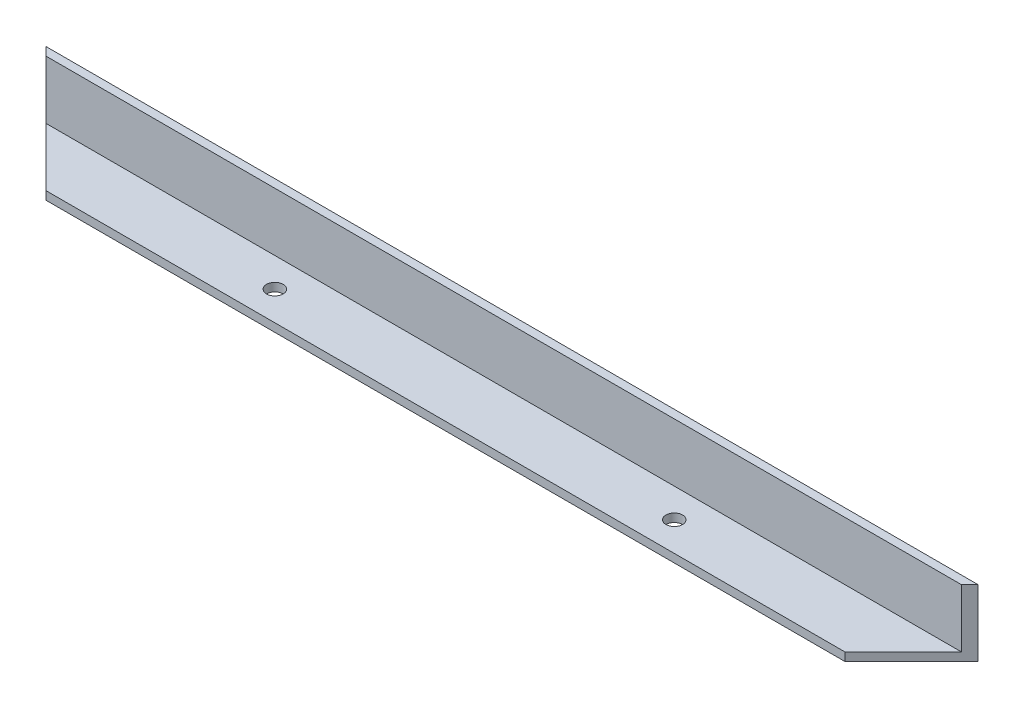
ISO-10303-21;
HEADER;
FILE_DESCRIPTION(('STEP AP214'),'2;1');
FILE_NAME('part.step','',(''),(''),'','','');
FILE_SCHEMA(('AUTOMOTIVE_DESIGN { 1 0 10303 214 1 1 1 1 }'));
ENDSEC;
DATA;
#1=APPLICATION_CONTEXT('core data for automotive mechanical design processes');
#2=APPLICATION_PROTOCOL_DEFINITION('international standard','automotive_design',2000,#1);
#3=PRODUCT_CONTEXT('',#1,'mechanical');
#4=PRODUCT('Part','Part','',(#3));
#5=PRODUCT_RELATED_PRODUCT_CATEGORY('part','',(#4));
#6=PRODUCT_DEFINITION_FORMATION('','',#4);
#7=PRODUCT_DEFINITION_CONTEXT('part definition',#1,'design');
#8=PRODUCT_DEFINITION('design','',#6,#7);
#9=PRODUCT_DEFINITION_SHAPE('','',#8);
#10=(LENGTH_UNIT() NAMED_UNIT(*) SI_UNIT(.MILLI.,.METRE.));
#11=(NAMED_UNIT(*) PLANE_ANGLE_UNIT() SI_UNIT($,.RADIAN.));
#12=(NAMED_UNIT(*) SI_UNIT($,.STERADIAN.) SOLID_ANGLE_UNIT());
#13=UNCERTAINTY_MEASURE_WITH_UNIT(LENGTH_MEASURE(1.E-05),#10,'distance_accuracy_value','');
#14=(GEOMETRIC_REPRESENTATION_CONTEXT(3) GLOBAL_UNCERTAINTY_ASSIGNED_CONTEXT((#13)) GLOBAL_UNIT_ASSIGNED_CONTEXT((#10,
#11,#12)) REPRESENTATION_CONTEXT('',''));
#15=CARTESIAN_POINT('',(0.,0.,0.));
#16=DIRECTION('',(0.,0.,1.));
#17=DIRECTION('',(1.,0.,0.));
#18=AXIS2_PLACEMENT_3D('',#15,#16,#17);
#19=CARTESIAN_POINT('',(0.,3.175,0.));
#20=DIRECTION('',(0.,-1.,0.));
#21=DIRECTION('',(0.,0.,-1.));
#22=AXIS2_PLACEMENT_3D('',#19,#20,#21);
#23=PLANE('',#22);
#24=CARTESIAN_POINT('',(-254.,3.175,14.2875));
#25=DIRECTION('',(0.,1.,0.));
#26=DIRECTION('',(0.,0.,-1.));
#27=AXIS2_PLACEMENT_3D('',#24,#25,#26);
#28=CIRCLE('',#27,3.17500000000003);
#29=CARTESIAN_POINT('',(-254.,3.175,11.1124999999999));
#30=VERTEX_POINT('',#29);
#31=EDGE_CURVE('E142',#30,#30,#28,.T.);
#32=ORIENTED_EDGE('',*,*,#31,.F.);
#33=EDGE_LOOP('',(#32));
#34=FACE_BOUND('',#33,.T.);
#35=CARTESIAN_POINT('',(-101.6,3.175,14.2875));
#36=DIRECTION('',(0.,1.,0.));
#37=DIRECTION('',(0.,0.,1.));
#38=AXIS2_PLACEMENT_3D('',#35,#36,#37);
#39=CIRCLE('',#38,3.17500000000001);
#40=CARTESIAN_POINT('',(-101.6,3.175,17.4625));
#41=VERTEX_POINT('',#40);
#42=EDGE_CURVE('E136',#41,#41,#39,.T.);
#43=ORIENTED_EDGE('',*,*,#42,.F.);
#44=EDGE_LOOP('',(#43));
#45=FACE_BOUND('',#44,.T.);
#46=DIRECTION('',(1.,0.,0.));
#47=VECTOR('',#46,1.);
#48=CARTESIAN_POINT('',(0.,3.175,25.4));
#49=LINE('',#48,#47);
#50=CARTESIAN_POINT('',(-330.2,3.175,25.4000000000001));
#51=VERTEX_POINT('',#50);
#52=CARTESIAN_POINT('',(-25.3999999999999,3.175,25.4));
#53=VERTEX_POINT('',#52);
#54=EDGE_CURVE('E105',#51,#53,#49,.T.);
#55=ORIENTED_EDGE('',*,*,#54,.T.);
#56=DIRECTION('',(0.707106781186546,0.,-0.707106781186549));
#57=VECTOR('',#56,1.);
#58=CARTESIAN_POINT('',(0.,3.175,0.));
#59=LINE('',#58,#57);
#60=CARTESIAN_POINT('',(-3.17499999999998,3.175,3.175));
#61=VERTEX_POINT('',#60);
#62=EDGE_CURVE('E127',#53,#61,#59,.T.);
#63=ORIENTED_EDGE('',*,*,#62,.T.);
#64=DIRECTION('',(1.,0.,0.));
#65=VECTOR('',#64,1.);
#66=CARTESIAN_POINT('',(-355.6,3.175,3.175));
#67=LINE('',#66,#65);
#68=CARTESIAN_POINT('',(-352.425,3.175,3.175));
#69=VERTEX_POINT('',#68);
#70=EDGE_CURVE('E111',#69,#61,#67,.T.);
#71=ORIENTED_EDGE('',*,*,#70,.F.);
#72=DIRECTION('',(0.707106781186551,0.,0.707106781186544));
#73=VECTOR('',#72,1.);
#74=CARTESIAN_POINT('',(-177.799999999998,3.175,177.8));
#75=LINE('',#74,#73);
#76=EDGE_CURVE('E121',#69,#51,#75,.T.);
#77=ORIENTED_EDGE('',*,*,#76,.T.);
#78=EDGE_LOOP('',(#55,#63,#71,#77));
#79=FACE_BOUND('',#78,.T.);
#80=ADVANCED_FACE('F32',(#34,#45,#79),#23,.F.);
#81=CARTESIAN_POINT('',(0.,3.175,0.));
#82=DIRECTION('',(0.,0.,1.));
#83=DIRECTION('',(1.,0.,0.));
#84=AXIS2_PLACEMENT_3D('',#81,#82,#83);
#85=PLANE('',#84);
#86=DIRECTION('',(-1.,0.,0.));
#87=VECTOR('',#86,1.);
#88=CARTESIAN_POINT('',(0.,0.,0.));
#89=LINE('',#88,#87);
#90=CARTESIAN_POINT('',(0.,0.,0.));
#91=VERTEX_POINT('',#90);
#92=CARTESIAN_POINT('',(-355.6,0.,0.));
#93=VERTEX_POINT('',#92);
#94=EDGE_CURVE('E94',#91,#93,#89,.T.);
#95=ORIENTED_EDGE('',*,*,#94,.T.);
#96=DIRECTION('',(0.,-1.,0.));
#97=VECTOR('',#96,1.);
#98=CARTESIAN_POINT('',(-355.6,3.175,0.));
#99=LINE('',#98,#97);
#100=CARTESIAN_POINT('',(-355.6,25.4,0.));
#101=VERTEX_POINT('',#100);
#102=EDGE_CURVE('E104',#101,#93,#99,.T.);
#103=ORIENTED_EDGE('',*,*,#102,.F.);
#104=DIRECTION('',(-1.,0.,0.));
#105=VECTOR('',#104,1.);
#106=CARTESIAN_POINT('',(-355.6,25.4,0.));
#107=LINE('',#106,#105);
#108=CARTESIAN_POINT('',(0.,25.4,0.));
#109=VERTEX_POINT('',#108);
#110=EDGE_CURVE('E100',#109,#101,#107,.T.);
#111=ORIENTED_EDGE('',*,*,#110,.F.);
#112=DIRECTION('',(0.,-1.,0.));
#113=VECTOR('',#112,1.);
#114=CARTESIAN_POINT('',(0.,3.175,0.));
#115=LINE('',#114,#113);
#116=EDGE_CURVE('E40',#109,#91,#115,.T.);
#117=ORIENTED_EDGE('',*,*,#116,.T.);
#118=EDGE_LOOP('',(#95,#103,#111,#117));
#119=FACE_BOUND('',#118,.T.);
#120=ADVANCED_FACE('F34',(#119),#85,.F.);
#121=CARTESIAN_POINT('',(0.,3.175,25.4));
#122=DIRECTION('',(0.,0.,-1.));
#123=DIRECTION('',(-1.,0.,0.));
#124=AXIS2_PLACEMENT_3D('',#121,#122,#123);
#125=PLANE('',#124);
#126=DIRECTION('',(1.,0.,0.));
#127=VECTOR('',#126,1.);
#128=CARTESIAN_POINT('',(0.,0.,25.4));
#129=LINE('',#128,#127);
#130=CARTESIAN_POINT('',(-330.2,0.,25.4000000000001));
#131=VERTEX_POINT('',#130);
#132=CARTESIAN_POINT('',(-25.4,0.,25.4000000000001));
#133=VERTEX_POINT('',#132);
#134=EDGE_CURVE('E99',#131,#133,#129,.T.);
#135=ORIENTED_EDGE('',*,*,#134,.T.);
#136=DIRECTION('',(0.,1.,0.));
#137=VECTOR('',#136,1.);
#138=CARTESIAN_POINT('',(-25.3999999999999,3.175,25.4));
#139=LINE('',#138,#137);
#140=EDGE_CURVE('E85',#133,#53,#139,.T.);
#141=ORIENTED_EDGE('',*,*,#140,.T.);
#142=ORIENTED_EDGE('',*,*,#54,.F.);
#143=DIRECTION('',(0.,-1.,0.));
#144=VECTOR('',#143,1.);
#145=CARTESIAN_POINT('',(-330.2,3.175,25.4));
#146=LINE('',#145,#144);
#147=EDGE_CURVE('E115',#51,#131,#146,.T.);
#148=ORIENTED_EDGE('',*,*,#147,.T.);
#149=EDGE_LOOP('',(#135,#141,#142,#148));
#150=FACE_BOUND('',#149,.T.);
#151=ADVANCED_FACE('F157',(#150),#125,.F.);
#152=CARTESIAN_POINT('',(0.,0.,0.));
#153=DIRECTION('',(0.,-1.,0.));
#154=DIRECTION('',(0.,0.,-1.));
#155=AXIS2_PLACEMENT_3D('',#152,#153,#154);
#156=PLANE('',#155);
#157=CARTESIAN_POINT('',(-254.,0.,14.2875));
#158=DIRECTION('',(0.,-1.,0.));
#159=DIRECTION('',(0.,0.,-1.));
#160=AXIS2_PLACEMENT_3D('',#157,#158,#159);
#161=CIRCLE('',#160,3.17500000000003);
#162=CARTESIAN_POINT('',(-254.,0.,11.1124999999999));
#163=VERTEX_POINT('',#162);
#164=EDGE_CURVE('E139',#163,#163,#161,.F.);
#165=ORIENTED_EDGE('',*,*,#164,.T.);
#166=EDGE_LOOP('',(#165));
#167=FACE_BOUND('',#166,.T.);
#168=CARTESIAN_POINT('',(-101.6,0.,14.2875));
#169=DIRECTION('',(0.,-1.,0.));
#170=DIRECTION('',(0.,0.,-1.));
#171=AXIS2_PLACEMENT_3D('',#168,#169,#170);
#172=CIRCLE('',#171,3.17500000000001);
#173=CARTESIAN_POINT('',(-101.6,0.,11.1124999999999));
#174=VERTEX_POINT('',#173);
#175=EDGE_CURVE('E133',#174,#174,#172,.F.);
#176=ORIENTED_EDGE('',*,*,#175,.T.);
#177=EDGE_LOOP('',(#176));
#178=FACE_BOUND('',#177,.T.);
#179=DIRECTION('',(-0.707106781186546,0.,0.707106781186549));
#180=VECTOR('',#179,1.);
#181=CARTESIAN_POINT('',(0.,0.,0.));
#182=LINE('',#181,#180);
#183=EDGE_CURVE('E81',#91,#133,#182,.T.);
#184=ORIENTED_EDGE('',*,*,#183,.T.);
#185=ORIENTED_EDGE('',*,*,#134,.F.);
#186=DIRECTION('',(-0.707106781186551,0.,-0.707106781186544));
#187=VECTOR('',#186,1.);
#188=CARTESIAN_POINT('',(-355.6,0.,0.));
#189=LINE('',#188,#187);
#190=EDGE_CURVE('E96',#131,#93,#189,.T.);
#191=ORIENTED_EDGE('',*,*,#190,.T.);
#192=ORIENTED_EDGE('',*,*,#94,.F.);
#193=EDGE_LOOP('',(#184,#185,#191,#192));
#194=FACE_BOUND('',#193,.T.);
#195=ADVANCED_FACE('F95',(#167,#178,#194),#156,.T.);
#196=CARTESIAN_POINT('',(-355.6,25.4,3.175));
#197=DIRECTION('',(0.,0.,-1.));
#198=DIRECTION('',(-1.,0.,0.));
#199=AXIS2_PLACEMENT_3D('',#196,#197,#198);
#200=PLANE('',#199);
#201=ORIENTED_EDGE('',*,*,#70,.T.);
#202=DIRECTION('',(0.,1.,0.));
#203=VECTOR('',#202,1.);
#204=CARTESIAN_POINT('',(-3.17499999999998,25.4,3.175));
#205=LINE('',#204,#203);
#206=CARTESIAN_POINT('',(-3.17499999999999,25.4,3.175));
#207=VERTEX_POINT('',#206);
#208=EDGE_CURVE('E89',#61,#207,#205,.T.);
#209=ORIENTED_EDGE('',*,*,#208,.T.);
#210=DIRECTION('',(1.,0.,0.));
#211=VECTOR('',#210,1.);
#212=CARTESIAN_POINT('',(-355.6,25.4,3.175));
#213=LINE('',#212,#211);
#214=CARTESIAN_POINT('',(-352.425,25.4,3.17499999999998));
#215=VERTEX_POINT('',#214);
#216=EDGE_CURVE('E114',#215,#207,#213,.T.);
#217=ORIENTED_EDGE('',*,*,#216,.F.);
#218=DIRECTION('',(0.,-1.,0.));
#219=VECTOR('',#218,1.);
#220=CARTESIAN_POINT('',(-352.425,25.4,3.175));
#221=LINE('',#220,#219);
#222=EDGE_CURVE('E46',#215,#69,#221,.T.);
#223=ORIENTED_EDGE('',*,*,#222,.T.);
#224=EDGE_LOOP('',(#201,#209,#217,#223));
#225=FACE_BOUND('',#224,.T.);
#226=ADVANCED_FACE('F163',(#225),#200,.F.);
#227=CARTESIAN_POINT('',(0.,25.4,0.));
#228=DIRECTION('',(0.,1.,0.));
#229=DIRECTION('',(0.,0.,1.));
#230=AXIS2_PLACEMENT_3D('',#227,#228,#229);
#231=PLANE('',#230);
#232=DIRECTION('',(-0.707106781186546,0.,0.707106781186549));
#233=VECTOR('',#232,1.);
#234=CARTESIAN_POINT('',(0.,25.4,0.));
#235=LINE('',#234,#233);
#236=EDGE_CURVE('E90',#109,#207,#235,.T.);
#237=ORIENTED_EDGE('',*,*,#236,.F.);
#238=ORIENTED_EDGE('',*,*,#110,.T.);
#239=DIRECTION('',(-0.707106781186551,0.,-0.707106781186544));
#240=VECTOR('',#239,1.);
#241=CARTESIAN_POINT('',(-177.799999999998,25.4,177.8));
#242=LINE('',#241,#240);
#243=EDGE_CURVE('E11',#215,#101,#242,.T.);
#244=ORIENTED_EDGE('',*,*,#243,.F.);
#245=ORIENTED_EDGE('',*,*,#216,.T.);
#246=EDGE_LOOP('',(#237,#238,#244,#245));
#247=FACE_BOUND('',#246,.T.);
#248=ADVANCED_FACE('F160',(#247),#231,.T.);
#249=CARTESIAN_POINT('',(-355.6,-98.2679186461468,0.));
#250=DIRECTION('',(0.707106781186544,0.,-0.707106781186551));
#251=DIRECTION('',(-0.707106781186551,0.,-0.707106781186544));
#252=AXIS2_PLACEMENT_3D('',#249,#250,#251);
#253=PLANE('',#252);
#254=ORIENTED_EDGE('',*,*,#76,.F.);
#255=ORIENTED_EDGE('',*,*,#222,.F.);
#256=ORIENTED_EDGE('',*,*,#243,.T.);
#257=ORIENTED_EDGE('',*,*,#102,.T.);
#258=ORIENTED_EDGE('',*,*,#190,.F.);
#259=ORIENTED_EDGE('',*,*,#147,.F.);
#260=EDGE_LOOP('',(#254,#255,#256,#257,#258,#259));
#261=FACE_BOUND('',#260,.T.);
#262=ADVANCED_FACE('F158',(#261),#253,.F.);
#263=CARTESIAN_POINT('',(0.,-98.2679186461468,0.));
#264=DIRECTION('',(-0.707106781186549,0.,-0.707106781186546));
#265=DIRECTION('',(-0.707106781186546,0.,0.707106781186549));
#266=AXIS2_PLACEMENT_3D('',#263,#264,#265);
#267=PLANE('',#266);
#268=ORIENTED_EDGE('',*,*,#183,.F.);
#269=ORIENTED_EDGE('',*,*,#116,.F.);
#270=ORIENTED_EDGE('',*,*,#236,.T.);
#271=ORIENTED_EDGE('',*,*,#208,.F.);
#272=ORIENTED_EDGE('',*,*,#62,.F.);
#273=ORIENTED_EDGE('',*,*,#140,.F.);
#274=EDGE_LOOP('',(#268,#269,#270,#271,#272,#273));
#275=FACE_BOUND('',#274,.T.);
#276=ADVANCED_FACE('F83',(#275),#267,.F.);
#277=CARTESIAN_POINT('',(-101.6,-8.98025612106924,14.2875));
#278=DIRECTION('',(0.,1.,0.));
#279=DIRECTION('',(0.,0.,1.));
#280=AXIS2_PLACEMENT_3D('',#277,#278,#279);
#281=CYLINDRICAL_SURFACE('',#280,3.17500000000001);
#282=ORIENTED_EDGE('',*,*,#42,.T.);
#283=EDGE_LOOP('',(#282));
#284=FACE_BOUND('',#283,.T.);
#285=ORIENTED_EDGE('',*,*,#175,.F.);
#286=EDGE_LOOP('',(#285));
#287=FACE_BOUND('',#286,.T.);
#288=ADVANCED_FACE('F201',(#284,#287),#281,.F.);
#289=CARTESIAN_POINT('',(-254.,-8.98025612106924,14.2875));
#290=DIRECTION('',(0.,1.,0.));
#291=DIRECTION('',(0.,0.,1.));
#292=AXIS2_PLACEMENT_3D('',#289,#290,#291);
#293=CYLINDRICAL_SURFACE('',#292,3.17500000000003);
#294=ORIENTED_EDGE('',*,*,#31,.T.);
#295=EDGE_LOOP('',(#294));
#296=FACE_BOUND('',#295,.T.);
#297=ORIENTED_EDGE('',*,*,#164,.F.);
#298=EDGE_LOOP('',(#297));
#299=FACE_BOUND('',#298,.T.);
#300=ADVANCED_FACE('F146',(#296,#299),#293,.F.);
#301=CLOSED_SHELL('',(#80,#120,#151,#195,#226,#248,#262,#276,#288,#300));
#302=MANIFOLD_SOLID_BREP('B2',#301);
#303=ADVANCED_BREP_SHAPE_REPRESENTATION('',(#18,#302),#14);
#304=SHAPE_DEFINITION_REPRESENTATION(#9,#303);
ENDSEC;
END-ISO-10303-21;
